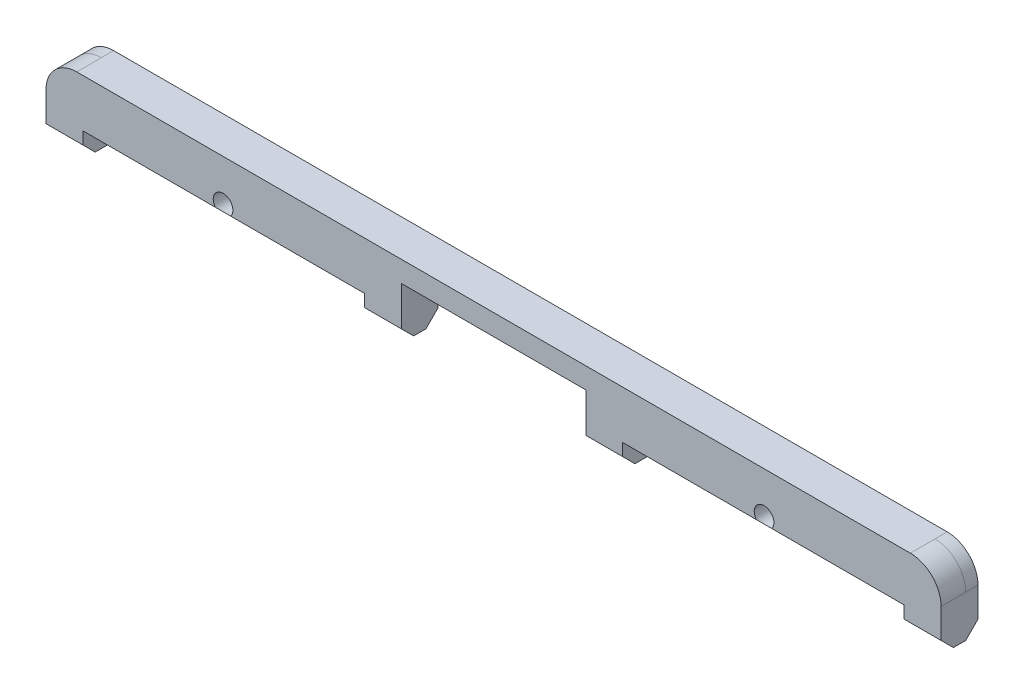
ISO-10303-21;
HEADER;
FILE_DESCRIPTION(('STEP AP214'),'2;1');
FILE_NAME('part.step','',(''),(''),'','','');
FILE_SCHEMA(('AUTOMOTIVE_DESIGN { 1 0 10303 214 1 1 1 1 }'));
ENDSEC;
DATA;
#1=APPLICATION_CONTEXT('core data for automotive mechanical design processes');
#2=APPLICATION_PROTOCOL_DEFINITION('international standard','automotive_design',2000,#1);
#3=PRODUCT_CONTEXT('',#1,'mechanical');
#4=PRODUCT('Part','Part','',(#3));
#5=PRODUCT_RELATED_PRODUCT_CATEGORY('part','',(#4));
#6=PRODUCT_DEFINITION_FORMATION('','',#4);
#7=PRODUCT_DEFINITION_CONTEXT('part definition',#1,'design');
#8=PRODUCT_DEFINITION('design','',#6,#7);
#9=PRODUCT_DEFINITION_SHAPE('','',#8);
#10=(LENGTH_UNIT() NAMED_UNIT(*) SI_UNIT(.MILLI.,.METRE.));
#11=(NAMED_UNIT(*) PLANE_ANGLE_UNIT() SI_UNIT($,.RADIAN.));
#12=(NAMED_UNIT(*) SI_UNIT($,.STERADIAN.) SOLID_ANGLE_UNIT());
#13=UNCERTAINTY_MEASURE_WITH_UNIT(LENGTH_MEASURE(1.E-05),#10,'distance_accuracy_value','');
#14=(GEOMETRIC_REPRESENTATION_CONTEXT(3) GLOBAL_UNCERTAINTY_ASSIGNED_CONTEXT((#13)) GLOBAL_UNIT_ASSIGNED_CONTEXT((#10,
#11,#12)) REPRESENTATION_CONTEXT('',''));
#15=CARTESIAN_POINT('',(0.,0.,0.));
#16=DIRECTION('',(0.,0.,1.));
#17=DIRECTION('',(1.,0.,0.));
#18=AXIS2_PLACEMENT_3D('',#15,#16,#17);
#19=CARTESIAN_POINT('',(39.6015621187164,-2.7,0.));
#20=DIRECTION('',(0.,0.707106781186547,-0.707106781186548));
#21=DIRECTION('',(0.,0.707106781186548,0.707106781186547));
#22=AXIS2_PLACEMENT_3D('',#19,#20,#21);
#23=PLANE('',#22);
#24=DIRECTION('',(-1.,0.,0.));
#25=VECTOR('',#24,1.);
#26=CARTESIAN_POINT('',(39.6015621187164,-0.699999999999999,2.));
#27=LINE('',#26,#25);
#28=CARTESIAN_POINT('',(-22.6244997998393,-0.699999999999999,2.));
#29=VERTEX_POINT('',#28);
#30=CARTESIAN_POINT('',(-33.4,-0.699999999999999,2.));
#31=VERTEX_POINT('',#30);
#32=EDGE_CURVE('E401',#29,#31,#27,.T.);
#33=ORIENTED_EDGE('',*,*,#32,.T.);
#34=DIRECTION('',(0.,0.707106781186548,0.707106781186547));
#35=VECTOR('',#34,1.);
#36=CARTESIAN_POINT('',(-33.4,-2.7,0.));
#37=LINE('',#36,#35);
#38=CARTESIAN_POINT('',(-33.4,-2.7,0.));
#39=VERTEX_POINT('',#38);
#40=EDGE_CURVE('E258',#39,#31,#37,.T.);
#41=ORIENTED_EDGE('',*,*,#40,.F.);
#42=DIRECTION('',(-1.,0.,0.));
#43=VECTOR('',#42,1.);
#44=CARTESIAN_POINT('',(39.6015621187164,-2.7,0.));
#45=LINE('',#44,#43);
#46=CARTESIAN_POINT('',(-10.5,-2.7,0.));
#47=VERTEX_POINT('',#46);
#48=EDGE_CURVE('E423',#47,#39,#45,.T.);
#49=ORIENTED_EDGE('',*,*,#48,.F.);
#50=DIRECTION('',(0.,-0.707106781186548,-0.707106781186547));
#51=VECTOR('',#50,1.);
#52=CARTESIAN_POINT('',(-10.5,-2.7,0.));
#53=LINE('',#52,#51);
#54=CARTESIAN_POINT('',(-10.5,-0.699999999999999,2.));
#55=VERTEX_POINT('',#54);
#56=EDGE_CURVE('E59',#55,#47,#53,.T.);
#57=ORIENTED_EDGE('',*,*,#56,.F.);
#58=CARTESIAN_POINT('',(-21.3755002001601,-0.699999999999998,2.));
#59=VERTEX_POINT('',#58);
#60=EDGE_CURVE('E428',#55,#59,#27,.T.);
#61=ORIENTED_EDGE('',*,*,#60,.T.);
#62=CARTESIAN_POINT('',(-21.9999999999997,-0.199999999999756,2.50000000000024));
#63=DIRECTION('',(0.,0.707106781186547,-0.707106781186548));
#64=DIRECTION('',(0.,0.707106781186548,0.707106781186547));
#65=AXIS2_PLACEMENT_3D('',#62,#63,#64);
#66=ELLIPSE('',#65,1.13137084989846,0.799999999999988);
#67=EDGE_CURVE('E467',#59,#29,#66,.T.);
#68=ORIENTED_EDGE('',*,*,#67,.T.);
#69=EDGE_LOOP('',(#33,#41,#49,#57,#61,#68));
#70=FACE_BOUND('',#69,.T.);
#71=ADVANCED_FACE('F43',(#70),#23,.F.);
#72=DIRECTION('',(0.,-0.707106781186548,-0.707106781186547));
#73=VECTOR('',#72,1.);
#74=CARTESIAN_POINT('',(10.5,-2.7,0.));
#75=LINE('',#74,#73);
#76=CARTESIAN_POINT('',(10.5,-0.699999999999999,2.));
#77=VERTEX_POINT('',#76);
#78=CARTESIAN_POINT('',(10.5,-2.7,0.));
#79=VERTEX_POINT('',#78);
#80=EDGE_CURVE('E290',#77,#79,#75,.T.);
#81=ORIENTED_EDGE('',*,*,#80,.T.);
#82=CARTESIAN_POINT('',(33.4,-2.7,0.));
#83=VERTEX_POINT('',#82);
#84=EDGE_CURVE('E422',#83,#79,#45,.T.);
#85=ORIENTED_EDGE('',*,*,#84,.F.);
#86=DIRECTION('',(0.,0.707106781186548,0.707106781186547));
#87=VECTOR('',#86,1.);
#88=CARTESIAN_POINT('',(33.4,-2.7,0.));
#89=LINE('',#88,#87);
#90=CARTESIAN_POINT('',(33.4,-0.699999999999999,2.));
#91=VERTEX_POINT('',#90);
#92=EDGE_CURVE('E67',#83,#91,#89,.T.);
#93=ORIENTED_EDGE('',*,*,#92,.T.);
#94=CARTESIAN_POINT('',(22.6244997998399,-0.699999999999998,2.));
#95=VERTEX_POINT('',#94);
#96=EDGE_CURVE('E424',#91,#95,#27,.T.);
#97=ORIENTED_EDGE('',*,*,#96,.T.);
#98=CARTESIAN_POINT('',(22.0000000000003,-0.199999999999756,2.50000000000024));
#99=DIRECTION('',(0.,0.707106781186547,-0.707106781186548));
#100=DIRECTION('',(0.,0.707106781186548,0.707106781186547));
#101=AXIS2_PLACEMENT_3D('',#98,#99,#100);
#102=ELLIPSE('',#101,1.13137084989846,0.79999999999999);
#103=CARTESIAN_POINT('',(21.3755002001607,-0.699999999999999,2.));
#104=VERTEX_POINT('',#103);
#105=EDGE_CURVE('E464',#95,#104,#102,.T.);
#106=ORIENTED_EDGE('',*,*,#105,.T.);
#107=EDGE_CURVE('E427',#104,#77,#27,.T.);
#108=ORIENTED_EDGE('',*,*,#107,.T.);
#109=EDGE_LOOP('',(#81,#85,#93,#97,#106,#108));
#110=FACE_BOUND('',#109,.T.);
#111=ADVANCED_FACE('F521',(#110),#23,.F.);
#112=CARTESIAN_POINT('',(36.4,-1.2,2.));
#113=DIRECTION('',(0.,0.,-1.));
#114=DIRECTION('',(-1.,0.,0.));
#115=AXIS2_PLACEMENT_3D('',#112,#113,#114);
#116=PLANE('',#115);
#117=DIRECTION('',(-1.,0.,0.));
#118=VECTOR('',#117,1.);
#119=CARTESIAN_POINT('',(36.4,1.49999999999995,2.));
#120=LINE('',#119,#118);
#121=CARTESIAN_POINT('',(7.50000000000001,1.49999999999994,2.));
#122=VERTEX_POINT('',#121);
#123=CARTESIAN_POINT('',(-7.50000000000001,1.49999999999994,2.));
#124=VERTEX_POINT('',#123);
#125=EDGE_CURVE('E368',#122,#124,#120,.T.);
#126=ORIENTED_EDGE('',*,*,#125,.F.);
#127=DIRECTION('',(0.,1.,0.));
#128=VECTOR('',#127,1.);
#129=CARTESIAN_POINT('',(7.50000000000001,-1.20000000000001,2.));
#130=LINE('',#129,#128);
#131=CARTESIAN_POINT('',(7.50000000000001,-1.7,2.));
#132=VERTEX_POINT('',#131);
#133=EDGE_CURVE('E375',#132,#122,#130,.T.);
#134=ORIENTED_EDGE('',*,*,#133,.F.);
#135=DIRECTION('',(-1.,0.,0.));
#136=VECTOR('',#135,1.);
#137=CARTESIAN_POINT('',(10.5,-1.7,2.));
#138=LINE('',#137,#136);
#139=CARTESIAN_POINT('',(10.5,-1.7,2.));
#140=VERTEX_POINT('',#139);
#141=EDGE_CURVE('E314',#140,#132,#138,.T.);
#142=ORIENTED_EDGE('',*,*,#141,.F.);
#143=DIRECTION('',(0.,1.,0.));
#144=VECTOR('',#143,1.);
#145=CARTESIAN_POINT('',(10.5,-1.7,2.));
#146=LINE('',#145,#144);
#147=EDGE_CURVE('E303',#140,#77,#146,.T.);
#148=ORIENTED_EDGE('',*,*,#147,.T.);
#149=ORIENTED_EDGE('',*,*,#107,.F.);
#150=CARTESIAN_POINT('',(22.0000000000003,-0.199999999999756,2.));
#151=DIRECTION('',(0.,0.,1.));
#152=DIRECTION('',(1.,0.,0.));
#153=AXIS2_PLACEMENT_3D('',#150,#151,#152);
#154=CIRCLE('',#153,0.799999999999992);
#155=EDGE_CURVE('E385',#95,#104,#154,.T.);
#156=ORIENTED_EDGE('',*,*,#155,.F.);
#157=ORIENTED_EDGE('',*,*,#96,.F.);
#158=DIRECTION('',(0.,-1.,0.));
#159=VECTOR('',#158,1.);
#160=CARTESIAN_POINT('',(33.4,-1.7,2.));
#161=LINE('',#160,#159);
#162=CARTESIAN_POINT('',(33.4,-1.7,2.));
#163=VERTEX_POINT('',#162);
#164=EDGE_CURVE('E327',#91,#163,#161,.T.);
#165=ORIENTED_EDGE('',*,*,#164,.T.);
#166=DIRECTION('',(1.,0.,0.));
#167=VECTOR('',#166,1.);
#168=CARTESIAN_POINT('',(33.4,-1.7,2.));
#169=LINE('',#168,#167);
#170=CARTESIAN_POINT('',(36.4,-1.7,2.));
#171=VERTEX_POINT('',#170);
#172=EDGE_CURVE('E340',#163,#171,#169,.T.);
#173=ORIENTED_EDGE('',*,*,#172,.T.);
#174=DIRECTION('',(0.,-1.,0.));
#175=VECTOR('',#174,1.);
#176=CARTESIAN_POINT('',(36.4,-1.2,2.));
#177=LINE('',#176,#175);
#178=CARTESIAN_POINT('',(36.4,0.7,2.));
#179=VERTEX_POINT('',#178);
#180=EDGE_CURVE('E429',#179,#171,#177,.T.);
#181=ORIENTED_EDGE('',*,*,#180,.F.);
#182=CARTESIAN_POINT('',(33.9,0.7,2.));
#183=DIRECTION('',(0.,0.,-1.));
#184=DIRECTION('',(-1.,0.,0.));
#185=AXIS2_PLACEMENT_3D('',#182,#183,#184);
#186=CIRCLE('',#185,2.5);
#187=CARTESIAN_POINT('',(33.9,3.2,2.));
#188=VERTEX_POINT('',#187);
#189=EDGE_CURVE('E444',#179,#188,#186,.F.);
#190=ORIENTED_EDGE('',*,*,#189,.T.);
#191=DIRECTION('',(-1.,0.,0.));
#192=VECTOR('',#191,1.);
#193=CARTESIAN_POINT('',(36.4,3.2,2.));
#194=LINE('',#193,#192);
#195=CARTESIAN_POINT('',(-33.9,3.2,2.));
#196=VERTEX_POINT('',#195);
#197=EDGE_CURVE('E432',#188,#196,#194,.T.);
#198=ORIENTED_EDGE('',*,*,#197,.T.);
#199=CARTESIAN_POINT('',(-33.9,0.7,2.));
#200=DIRECTION('',(0.,0.,-1.));
#201=DIRECTION('',(-1.,0.,0.));
#202=AXIS2_PLACEMENT_3D('',#199,#200,#201);
#203=CIRCLE('',#202,2.5);
#204=CARTESIAN_POINT('',(-36.4,0.7,2.));
#205=VERTEX_POINT('',#204);
#206=EDGE_CURVE('E447',#196,#205,#203,.F.);
#207=ORIENTED_EDGE('',*,*,#206,.T.);
#208=DIRECTION('',(0.,-1.,0.));
#209=VECTOR('',#208,1.);
#210=CARTESIAN_POINT('',(-36.4,-1.2,2.));
#211=LINE('',#210,#209);
#212=CARTESIAN_POINT('',(-36.4,-1.7,2.));
#213=VERTEX_POINT('',#212);
#214=EDGE_CURVE('E421',#205,#213,#211,.T.);
#215=ORIENTED_EDGE('',*,*,#214,.T.);
#216=DIRECTION('',(-1.,0.,0.));
#217=VECTOR('',#216,1.);
#218=CARTESIAN_POINT('',(-33.4,-1.7,2.));
#219=LINE('',#218,#217);
#220=CARTESIAN_POINT('',(-33.4,-1.7,2.));
#221=VERTEX_POINT('',#220);
#222=EDGE_CURVE('E273',#221,#213,#219,.T.);
#223=ORIENTED_EDGE('',*,*,#222,.F.);
#224=DIRECTION('',(0.,-1.,0.));
#225=VECTOR('',#224,1.);
#226=CARTESIAN_POINT('',(-33.4,-1.7,2.));
#227=LINE('',#226,#225);
#228=EDGE_CURVE('E262',#31,#221,#227,.T.);
#229=ORIENTED_EDGE('',*,*,#228,.F.);
#230=ORIENTED_EDGE('',*,*,#32,.F.);
#231=CARTESIAN_POINT('',(-21.9999999999997,-0.199999999999756,2.));
#232=DIRECTION('',(0.,0.,1.));
#233=DIRECTION('',(1.,0.,0.));
#234=AXIS2_PLACEMENT_3D('',#231,#232,#233);
#235=CIRCLE('',#234,0.799999999999988);
#236=EDGE_CURVE('E378',#59,#29,#235,.T.);
#237=ORIENTED_EDGE('',*,*,#236,.F.);
#238=ORIENTED_EDGE('',*,*,#60,.F.);
#239=DIRECTION('',(0.,1.,0.));
#240=VECTOR('',#239,1.);
#241=CARTESIAN_POINT('',(-10.5,-1.7,2.));
#242=LINE('',#241,#240);
#243=CARTESIAN_POINT('',(-10.5,-1.7,2.));
#244=VERTEX_POINT('',#243);
#245=EDGE_CURVE('E240',#244,#55,#242,.T.);
#246=ORIENTED_EDGE('',*,*,#245,.F.);
#247=DIRECTION('',(1.,0.,0.));
#248=VECTOR('',#247,1.);
#249=CARTESIAN_POINT('',(-10.5,-1.7,2.));
#250=LINE('',#249,#248);
#251=CARTESIAN_POINT('',(-7.50000000000001,-1.7,2.));
#252=VERTEX_POINT('',#251);
#253=EDGE_CURVE('E233',#244,#252,#250,.T.);
#254=ORIENTED_EDGE('',*,*,#253,.T.);
#255=DIRECTION('',(0.,-1.,0.));
#256=VECTOR('',#255,1.);
#257=CARTESIAN_POINT('',(-7.50000000000001,-1.20000000000001,2.));
#258=LINE('',#257,#256);
#259=EDGE_CURVE('E365',#124,#252,#258,.T.);
#260=ORIENTED_EDGE('',*,*,#259,.F.);
#261=EDGE_LOOP('',(#126,#134,#142,#148,#149,#156,#157,#165,#173,#181,#190,#198,#207,#215,#223,
#229,#230,#237,#238,#246,#254,#260));
#262=FACE_BOUND('',#261,.T.);
#263=ADVANCED_FACE('F509',(#262),#116,.F.);
#264=CARTESIAN_POINT('',(42.3841457201509,-2.7,0.));
#265=DIRECTION('',(0.,-0.707106781186544,-0.707106781186551));
#266=DIRECTION('',(0.,0.707106781186551,-0.707106781186544));
#267=AXIS2_PLACEMENT_3D('',#264,#265,#266);
#268=PLANE('',#267);
#269=CARTESIAN_POINT('',(36.4,-2.7,0.));
#270=VERTEX_POINT('',#269);
#271=EDGE_CURVE('E417',#270,#83,#45,.T.);
#272=ORIENTED_EDGE('',*,*,#271,.T.);
#273=ORIENTED_EDGE('',*,*,#84,.T.);
#274=DIRECTION('',(-1.,0.,0.));
#275=VECTOR('',#274,1.);
#276=CARTESIAN_POINT('',(10.5,-2.7,0.));
#277=LINE('',#276,#275);
#278=CARTESIAN_POINT('',(7.50000000000002,-2.7,0.));
#279=VERTEX_POINT('',#278);
#280=EDGE_CURVE('E307',#79,#279,#277,.T.);
#281=ORIENTED_EDGE('',*,*,#280,.T.);
#282=DIRECTION('',(0.,0.707106781186551,-0.707106781186544));
#283=VECTOR('',#282,1.);
#284=CARTESIAN_POINT('',(7.50000000000001,-2.7,0.));
#285=LINE('',#284,#283);
#286=CARTESIAN_POINT('',(7.50000000000001,-1.69999999999999,-1.));
#287=VERTEX_POINT('',#286);
#288=EDGE_CURVE('E371',#279,#287,#285,.T.);
#289=ORIENTED_EDGE('',*,*,#288,.T.);
#290=DIRECTION('',(-1.,0.,0.));
#291=VECTOR('',#290,1.);
#292=CARTESIAN_POINT('',(42.3841457201509,-1.69999999999999,-1.));
#293=LINE('',#292,#291);
#294=CARTESIAN_POINT('',(36.4,-1.69999999999999,-1.));
#295=VERTEX_POINT('',#294);
#296=EDGE_CURVE('E398',#295,#287,#293,.T.);
#297=ORIENTED_EDGE('',*,*,#296,.F.);
#298=DIRECTION('',(0.,0.707106781186551,-0.707106781186544));
#299=VECTOR('',#298,1.);
#300=CARTESIAN_POINT('',(36.4,-2.7,0.));
#301=LINE('',#300,#299);
#302=EDGE_CURVE('E397',#270,#295,#301,.T.);
#303=ORIENTED_EDGE('',*,*,#302,.F.);
#304=EDGE_LOOP('',(#272,#273,#281,#289,#297,#303));
#305=FACE_BOUND('',#304,.T.);
#306=ADVANCED_FACE('F561',(#305),#268,.T.);
#307=CARTESIAN_POINT('',(-7.50000000000001,-1.69999999999999,-1.));
#308=VERTEX_POINT('',#307);
#309=CARTESIAN_POINT('',(-36.4,-1.69999999999999,-1.));
#310=VERTEX_POINT('',#309);
#311=EDGE_CURVE('E413',#308,#310,#293,.T.);
#312=ORIENTED_EDGE('',*,*,#311,.F.);
#313=DIRECTION('',(0.,-0.707106781186551,0.707106781186544));
#314=VECTOR('',#313,1.);
#315=CARTESIAN_POINT('',(-7.50000000000001,-2.70000000000001,0.));
#316=LINE('',#315,#314);
#317=CARTESIAN_POINT('',(-7.50000000000002,-2.7,0.));
#318=VERTEX_POINT('',#317);
#319=EDGE_CURVE('E361',#308,#318,#316,.T.);
#320=ORIENTED_EDGE('',*,*,#319,.T.);
#321=DIRECTION('',(1.,0.,0.));
#322=VECTOR('',#321,1.);
#323=CARTESIAN_POINT('',(-10.5,-2.7,0.));
#324=LINE('',#323,#322);
#325=EDGE_CURVE('E234',#47,#318,#324,.T.);
#326=ORIENTED_EDGE('',*,*,#325,.F.);
#327=ORIENTED_EDGE('',*,*,#48,.T.);
#328=DIRECTION('',(1.,0.,0.));
#329=VECTOR('',#328,1.);
#330=CARTESIAN_POINT('',(-39.6015621187164,-2.7,0.));
#331=LINE('',#330,#329);
#332=CARTESIAN_POINT('',(-36.4,-2.7,0.));
#333=VERTEX_POINT('',#332);
#334=EDGE_CURVE('E282',#333,#39,#331,.T.);
#335=ORIENTED_EDGE('',*,*,#334,.F.);
#336=DIRECTION('',(0.,-0.707106781186551,0.707106781186544));
#337=VECTOR('',#336,1.);
#338=CARTESIAN_POINT('',(-36.4,-2.7,0.));
#339=LINE('',#338,#337);
#340=EDGE_CURVE('E405',#310,#333,#339,.T.);
#341=ORIENTED_EDGE('',*,*,#340,.F.);
#342=EDGE_LOOP('',(#312,#320,#326,#327,#335,#341));
#343=FACE_BOUND('',#342,.T.);
#344=ADVANCED_FACE('F546',(#343),#268,.T.);
#345=CARTESIAN_POINT('',(42.3841457201509,-1.69999999999999,-1.));
#346=DIRECTION('',(0.,0.,-1.));
#347=DIRECTION('',(-1.,0.,0.));
#348=AXIS2_PLACEMENT_3D('',#345,#346,#347);
#349=PLANE('',#348);
#350=CARTESIAN_POINT('',(22.0000000000003,-0.199999999999756,-1.));
#351=DIRECTION('',(0.,0.,-1.));
#352=DIRECTION('',(-1.,0.,0.));
#353=AXIS2_PLACEMENT_3D('',#350,#351,#352);
#354=CIRCLE('',#353,0.79999999999999);
#355=CARTESIAN_POINT('',(21.2000000000003,-0.199999999999756,-1.));
#356=VERTEX_POINT('',#355);
#357=EDGE_CURVE('E388',#356,#356,#354,.T.);
#358=ORIENTED_EDGE('',*,*,#357,.F.);
#359=EDGE_LOOP('',(#358));
#360=FACE_BOUND('',#359,.T.);
#361=CARTESIAN_POINT('',(-21.9999999999997,-0.199999999999756,-1.));
#362=DIRECTION('',(0.,0.,-1.));
#363=DIRECTION('',(-1.,0.,0.));
#364=AXIS2_PLACEMENT_3D('',#361,#362,#363);
#365=CIRCLE('',#364,0.799999999999988);
#366=CARTESIAN_POINT('',(-22.7999999999997,-0.199999999999756,-1.));
#367=VERTEX_POINT('',#366);
#368=EDGE_CURVE('E381',#367,#367,#365,.T.);
#369=ORIENTED_EDGE('',*,*,#368,.F.);
#370=EDGE_LOOP('',(#369));
#371=FACE_BOUND('',#370,.T.);
#372=ORIENTED_EDGE('',*,*,#296,.T.);
#373=DIRECTION('',(0.,1.,0.));
#374=VECTOR('',#373,1.);
#375=CARTESIAN_POINT('',(7.50000000000001,-1.7,-1.));
#376=LINE('',#375,#374);
#377=CARTESIAN_POINT('',(7.50000000000001,1.49999999999994,-1.));
#378=VERTEX_POINT('',#377);
#379=EDGE_CURVE('E11',#287,#378,#376,.T.);
#380=ORIENTED_EDGE('',*,*,#379,.T.);
#381=DIRECTION('',(-1.,0.,0.));
#382=VECTOR('',#381,1.);
#383=CARTESIAN_POINT('',(42.3841457201509,1.49999999999995,-1.));
#384=LINE('',#383,#382);
#385=CARTESIAN_POINT('',(-7.50000000000001,1.49999999999994,-1.));
#386=VERTEX_POINT('',#385);
#387=EDGE_CURVE('E52',#378,#386,#384,.T.);
#388=ORIENTED_EDGE('',*,*,#387,.T.);
#389=DIRECTION('',(0.,-1.,0.));
#390=VECTOR('',#389,1.);
#391=CARTESIAN_POINT('',(-7.50000000000001,-1.7,-1.));
#392=LINE('',#391,#390);
#393=EDGE_CURVE('E491',#386,#308,#392,.T.);
#394=ORIENTED_EDGE('',*,*,#393,.T.);
#395=ORIENTED_EDGE('',*,*,#311,.T.);
#396=DIRECTION('',(0.,-1.,0.));
#397=VECTOR('',#396,1.);
#398=CARTESIAN_POINT('',(-36.4,-1.69999999999999,-1.));
#399=LINE('',#398,#397);
#400=CARTESIAN_POINT('',(-36.4,0.7,-1.));
#401=VERTEX_POINT('',#400);
#402=EDGE_CURVE('E392',#401,#310,#399,.T.);
#403=ORIENTED_EDGE('',*,*,#402,.F.);
#404=CARTESIAN_POINT('',(-33.9,0.7,-1.));
#405=DIRECTION('',(0.,0.,-1.));
#406=DIRECTION('',(-1.,0.,0.));
#407=AXIS2_PLACEMENT_3D('',#404,#405,#406);
#408=CIRCLE('',#407,2.5);
#409=CARTESIAN_POINT('',(-33.9,3.2,-1.));
#410=VERTEX_POINT('',#409);
#411=EDGE_CURVE('E478',#401,#410,#408,.T.);
#412=ORIENTED_EDGE('',*,*,#411,.T.);
#413=DIRECTION('',(-1.,0.,0.));
#414=VECTOR('',#413,1.);
#415=CARTESIAN_POINT('',(42.3841457201509,3.2,-1.));
#416=LINE('',#415,#414);
#417=CARTESIAN_POINT('',(33.9,3.2,-1.));
#418=VERTEX_POINT('',#417);
#419=EDGE_CURVE('E409',#418,#410,#416,.T.);
#420=ORIENTED_EDGE('',*,*,#419,.F.);
#421=CARTESIAN_POINT('',(33.9,0.7,-1.));
#422=DIRECTION('',(0.,0.,-1.));
#423=DIRECTION('',(-1.,0.,0.));
#424=AXIS2_PLACEMENT_3D('',#421,#422,#423);
#425=CIRCLE('',#424,2.5);
#426=CARTESIAN_POINT('',(36.4,0.7,-1.));
#427=VERTEX_POINT('',#426);
#428=EDGE_CURVE('E475',#418,#427,#425,.T.);
#429=ORIENTED_EDGE('',*,*,#428,.T.);
#430=DIRECTION('',(0.,1.,0.));
#431=VECTOR('',#430,1.);
#432=CARTESIAN_POINT('',(36.4,-1.69999999999999,-1.));
#433=LINE('',#432,#431);
#434=EDGE_CURVE('E393',#295,#427,#433,.T.);
#435=ORIENTED_EDGE('',*,*,#434,.F.);
#436=EDGE_LOOP('',(#372,#380,#388,#394,#395,#403,#412,#420,#429,#435));
#437=FACE_BOUND('',#436,.T.);
#438=ADVANCED_FACE('F497',(#360,#371,#437),#349,.T.);
#439=CARTESIAN_POINT('',(36.4,3.2,2.));
#440=DIRECTION('',(0.,-1.,0.));
#441=DIRECTION('',(0.,0.,-1.));
#442=AXIS2_PLACEMENT_3D('',#439,#440,#441);
#443=PLANE('',#442);
#444=ORIENTED_EDGE('',*,*,#419,.T.);
#445=DIRECTION('',(0.,0.,-1.));
#446=VECTOR('',#445,1.);
#447=CARTESIAN_POINT('',(-33.9,3.2,0.));
#448=LINE('',#447,#446);
#449=CARTESIAN_POINT('',(-33.9,3.2,0.));
#450=VERTEX_POINT('',#449);
#451=EDGE_CURVE('E484',#410,#450,#448,.F.);
#452=ORIENTED_EDGE('',*,*,#451,.T.);
#453=DIRECTION('',(0.,0.,1.));
#454=VECTOR('',#453,1.);
#455=CARTESIAN_POINT('',(-33.9,3.2,2.));
#456=LINE('',#455,#454);
#457=EDGE_CURVE('E440',#450,#196,#456,.T.);
#458=ORIENTED_EDGE('',*,*,#457,.T.);
#459=ORIENTED_EDGE('',*,*,#197,.F.);
#460=DIRECTION('',(0.,0.,1.));
#461=VECTOR('',#460,1.);
#462=CARTESIAN_POINT('',(33.9,3.2,2.));
#463=LINE('',#462,#461);
#464=CARTESIAN_POINT('',(33.9,3.2,0.));
#465=VERTEX_POINT('',#464);
#466=EDGE_CURVE('E438',#188,#465,#463,.F.);
#467=ORIENTED_EDGE('',*,*,#466,.T.);
#468=DIRECTION('',(0.,0.,1.));
#469=VECTOR('',#468,1.);
#470=CARTESIAN_POINT('',(33.9,3.2,2.));
#471=LINE('',#470,#469);
#472=EDGE_CURVE('E481',#465,#418,#471,.F.);
#473=ORIENTED_EDGE('',*,*,#472,.T.);
#474=EDGE_LOOP('',(#444,#452,#458,#459,#467,#473));
#475=FACE_BOUND('',#474,.T.);
#476=ADVANCED_FACE('F604',(#475),#443,.F.);
#477=CARTESIAN_POINT('',(36.4,0.,0.));
#478=DIRECTION('',(-1.,0.,0.));
#479=DIRECTION('',(0.,0.,1.));
#480=AXIS2_PLACEMENT_3D('',#477,#478,#479);
#481=PLANE('',#480);
#482=ORIENTED_EDGE('',*,*,#180,.T.);
#483=DIRECTION('',(0.,-0.707106781186548,-0.707106781186547));
#484=VECTOR('',#483,1.);
#485=CARTESIAN_POINT('',(36.4,-2.7,0.999999999999999));
#486=LINE('',#485,#484);
#487=CARTESIAN_POINT('',(36.4,-2.7,0.999999999999999));
#488=VERTEX_POINT('',#487);
#489=EDGE_CURVE('E318',#171,#488,#486,.T.);
#490=ORIENTED_EDGE('',*,*,#489,.T.);
#491=DIRECTION('',(0.,0.,-1.));
#492=VECTOR('',#491,1.);
#493=CARTESIAN_POINT('',(36.4,-2.7,0.));
#494=LINE('',#493,#492);
#495=EDGE_CURVE('E328',#488,#270,#494,.T.);
#496=ORIENTED_EDGE('',*,*,#495,.T.);
#497=ORIENTED_EDGE('',*,*,#302,.T.);
#498=ORIENTED_EDGE('',*,*,#434,.T.);
#499=DIRECTION('',(0.,0.,1.));
#500=VECTOR('',#499,1.);
#501=CARTESIAN_POINT('',(36.4,0.7,0.));
#502=LINE('',#501,#500);
#503=CARTESIAN_POINT('',(36.4,0.7,0.));
#504=VERTEX_POINT('',#503);
#505=EDGE_CURVE('E487',#427,#504,#502,.T.);
#506=ORIENTED_EDGE('',*,*,#505,.T.);
#507=DIRECTION('',(0.,0.,1.));
#508=VECTOR('',#507,1.);
#509=CARTESIAN_POINT('',(36.4,0.7,0.));
#510=LINE('',#509,#508);
#511=EDGE_CURVE('E460',#504,#179,#510,.T.);
#512=ORIENTED_EDGE('',*,*,#511,.T.);
#513=EDGE_LOOP('',(#482,#490,#496,#497,#498,#506,#512));
#514=FACE_BOUND('',#513,.T.);
#515=ADVANCED_FACE('F601',(#514),#481,.F.);
#516=CARTESIAN_POINT('',(-36.4,0.,0.));
#517=DIRECTION('',(-1.,0.,0.));
#518=DIRECTION('',(0.,0.,1.));
#519=AXIS2_PLACEMENT_3D('',#516,#517,#518);
#520=PLANE('',#519);
#521=DIRECTION('',(0.,0.,1.));
#522=VECTOR('',#521,1.);
#523=CARTESIAN_POINT('',(-36.4,0.7,0.));
#524=LINE('',#523,#522);
#525=CARTESIAN_POINT('',(-36.4,0.7,0.));
#526=VERTEX_POINT('',#525);
#527=EDGE_CURVE('E450',#205,#526,#524,.F.);
#528=ORIENTED_EDGE('',*,*,#527,.T.);
#529=DIRECTION('',(0.,0.,-1.));
#530=VECTOR('',#529,1.);
#531=CARTESIAN_POINT('',(-36.4,0.7,-1.));
#532=LINE('',#531,#530);
#533=EDGE_CURVE('E471',#526,#401,#532,.T.);
#534=ORIENTED_EDGE('',*,*,#533,.T.);
#535=ORIENTED_EDGE('',*,*,#402,.T.);
#536=ORIENTED_EDGE('',*,*,#340,.T.);
#537=DIRECTION('',(0.,0.,-1.));
#538=VECTOR('',#537,1.);
#539=CARTESIAN_POINT('',(-36.4,-2.7,0.));
#540=LINE('',#539,#538);
#541=CARTESIAN_POINT('',(-36.4,-2.7,0.999999999999999));
#542=VERTEX_POINT('',#541);
#543=EDGE_CURVE('E263',#542,#333,#540,.T.);
#544=ORIENTED_EDGE('',*,*,#543,.F.);
#545=DIRECTION('',(0.,-0.707106781186548,-0.707106781186547));
#546=VECTOR('',#545,1.);
#547=CARTESIAN_POINT('',(-36.4,-2.7,0.999999999999999));
#548=LINE('',#547,#546);
#549=EDGE_CURVE('E254',#213,#542,#548,.T.);
#550=ORIENTED_EDGE('',*,*,#549,.F.);
#551=ORIENTED_EDGE('',*,*,#214,.F.);
#552=EDGE_LOOP('',(#528,#534,#535,#536,#544,#550,#551));
#553=FACE_BOUND('',#552,.T.);
#554=ADVANCED_FACE('F549',(#553),#520,.T.);
#555=CARTESIAN_POINT('',(-33.9,0.7,2.));
#556=DIRECTION('',(0.,0.,-1.));
#557=DIRECTION('',(-1.,0.,0.));
#558=AXIS2_PLACEMENT_3D('',#555,#556,#557);
#559=CYLINDRICAL_SURFACE('',#558,2.5);
#560=CARTESIAN_POINT('',(-33.9,0.7,0.));
#561=DIRECTION('',(0.,0.,1.));
#562=DIRECTION('',(1.,0.,0.));
#563=AXIS2_PLACEMENT_3D('',#560,#561,#562);
#564=CIRCLE('',#563,2.5);
#565=EDGE_CURVE('E456',#526,#450,#564,.F.);
#566=ORIENTED_EDGE('',*,*,#565,.F.);
#567=ORIENTED_EDGE('',*,*,#527,.F.);
#568=ORIENTED_EDGE('',*,*,#206,.F.);
#569=ORIENTED_EDGE('',*,*,#457,.F.);
#570=EDGE_LOOP('',(#566,#567,#568,#569));
#571=FACE_BOUND('',#570,.T.);
#572=ADVANCED_FACE('F590',(#571),#559,.T.);
#573=CARTESIAN_POINT('',(33.9,0.7,0.));
#574=DIRECTION('',(0.,0.,1.));
#575=DIRECTION('',(1.,0.,0.));
#576=AXIS2_PLACEMENT_3D('',#573,#574,#575);
#577=CYLINDRICAL_SURFACE('',#576,2.5);
#578=CARTESIAN_POINT('',(33.9,0.7,0.));
#579=DIRECTION('',(0.,0.,1.));
#580=DIRECTION('',(1.,0.,0.));
#581=AXIS2_PLACEMENT_3D('',#578,#579,#580);
#582=CIRCLE('',#581,2.5);
#583=EDGE_CURVE('E453',#465,#504,#582,.F.);
#584=ORIENTED_EDGE('',*,*,#583,.F.);
#585=ORIENTED_EDGE('',*,*,#466,.F.);
#586=ORIENTED_EDGE('',*,*,#189,.F.);
#587=ORIENTED_EDGE('',*,*,#511,.F.);
#588=EDGE_LOOP('',(#584,#585,#586,#587));
#589=FACE_BOUND('',#588,.T.);
#590=ADVANCED_FACE('F580',(#589),#577,.T.);
#591=CARTESIAN_POINT('',(22.0000000000003,-0.199999999999756,2.));
#592=DIRECTION('',(0.,0.,1.));
#593=DIRECTION('',(1.,0.,0.));
#594=AXIS2_PLACEMENT_3D('',#591,#592,#593);
#595=CYLINDRICAL_SURFACE('',#594,0.79999999999999);
#596=ORIENTED_EDGE('',*,*,#357,.T.);
#597=EDGE_LOOP('',(#596));
#598=FACE_BOUND('',#597,.T.);
#599=ORIENTED_EDGE('',*,*,#155,.T.);
#600=ORIENTED_EDGE('',*,*,#105,.F.);
#601=EDGE_LOOP('',(#599,#600));
#602=FACE_BOUND('',#601,.T.);
#603=ADVANCED_FACE('F577',(#598,#602),#595,.F.);
#604=CARTESIAN_POINT('',(-21.9999999999997,-0.199999999999756,2.));
#605=DIRECTION('',(0.,0.,1.));
#606=DIRECTION('',(1.,0.,0.));
#607=AXIS2_PLACEMENT_3D('',#604,#605,#606);
#608=CYLINDRICAL_SURFACE('',#607,0.799999999999988);
#609=ORIENTED_EDGE('',*,*,#368,.T.);
#610=EDGE_LOOP('',(#609));
#611=FACE_BOUND('',#610,.T.);
#612=ORIENTED_EDGE('',*,*,#236,.T.);
#613=ORIENTED_EDGE('',*,*,#67,.F.);
#614=EDGE_LOOP('',(#612,#613));
#615=FACE_BOUND('',#614,.T.);
#616=ADVANCED_FACE('F579',(#611,#615),#608,.F.);
#617=CARTESIAN_POINT('',(-33.9,0.7,0.));
#618=DIRECTION('',(0.,0.,1.));
#619=DIRECTION('',(1.,0.,0.));
#620=AXIS2_PLACEMENT_3D('',#617,#618,#619);
#621=CYLINDRICAL_SURFACE('',#620,2.5);
#622=ORIENTED_EDGE('',*,*,#565,.T.);
#623=ORIENTED_EDGE('',*,*,#451,.F.);
#624=ORIENTED_EDGE('',*,*,#411,.F.);
#625=ORIENTED_EDGE('',*,*,#533,.F.);
#626=EDGE_LOOP('',(#622,#623,#624,#625));
#627=FACE_BOUND('',#626,.T.);
#628=ADVANCED_FACE('F587',(#627),#621,.T.);
#629=CARTESIAN_POINT('',(33.9,0.7,0.));
#630=DIRECTION('',(0.,0.,1.));
#631=DIRECTION('',(1.,0.,0.));
#632=AXIS2_PLACEMENT_3D('',#629,#630,#631);
#633=CYLINDRICAL_SURFACE('',#632,2.5);
#634=ORIENTED_EDGE('',*,*,#428,.F.);
#635=ORIENTED_EDGE('',*,*,#472,.F.);
#636=ORIENTED_EDGE('',*,*,#583,.T.);
#637=ORIENTED_EDGE('',*,*,#505,.F.);
#638=EDGE_LOOP('',(#634,#635,#636,#637));
#639=FACE_BOUND('',#638,.T.);
#640=ADVANCED_FACE('F45',(#639),#633,.T.);
#641=CARTESIAN_POINT('',(7.50000000000001,1.49999999999994,5.));
#642=DIRECTION('',(-1.,0.,0.));
#643=DIRECTION('',(0.,-1.,0.));
#644=AXIS2_PLACEMENT_3D('',#641,#642,#643);
#645=PLANE('',#644);
#646=ORIENTED_EDGE('',*,*,#288,.F.);
#647=DIRECTION('',(0.,0.,1.));
#648=VECTOR('',#647,1.);
#649=CARTESIAN_POINT('',(7.50000000000002,-2.7,0.));
#650=LINE('',#649,#648);
#651=CARTESIAN_POINT('',(7.50000000000002,-2.7,1.));
#652=VERTEX_POINT('',#651);
#653=EDGE_CURVE('E289',#279,#652,#650,.T.);
#654=ORIENTED_EDGE('',*,*,#653,.T.);
#655=DIRECTION('',(0.,0.707106781186548,0.707106781186547));
#656=VECTOR('',#655,1.);
#657=CARTESIAN_POINT('',(7.50000000000002,-2.7,1.));
#658=LINE('',#657,#656);
#659=EDGE_CURVE('E295',#652,#132,#658,.T.);
#660=ORIENTED_EDGE('',*,*,#659,.T.);
#661=ORIENTED_EDGE('',*,*,#133,.T.);
#662=DIRECTION('',(0.,0.,-1.));
#663=VECTOR('',#662,1.);
#664=CARTESIAN_POINT('',(7.50000000000001,1.49999999999994,5.));
#665=LINE('',#664,#663);
#666=EDGE_CURVE('E357',#122,#378,#665,.T.);
#667=ORIENTED_EDGE('',*,*,#666,.T.);
#668=ORIENTED_EDGE('',*,*,#379,.F.);
#669=EDGE_LOOP('',(#646,#654,#660,#661,#667,#668));
#670=FACE_BOUND('',#669,.T.);
#671=ADVANCED_FACE('F506',(#670),#645,.T.);
#672=CARTESIAN_POINT('',(7.50000000000001,1.49999999999994,5.));
#673=DIRECTION('',(0.,-1.,0.));
#674=DIRECTION('',(1.,0.,0.));
#675=AXIS2_PLACEMENT_3D('',#672,#673,#674);
#676=PLANE('',#675);
#677=ORIENTED_EDGE('',*,*,#125,.T.);
#678=DIRECTION('',(0.,0.,-1.));
#679=VECTOR('',#678,1.);
#680=CARTESIAN_POINT('',(-7.50000000000001,1.49999999999994,5.));
#681=LINE('',#680,#679);
#682=EDGE_CURVE('E350',#124,#386,#681,.T.);
#683=ORIENTED_EDGE('',*,*,#682,.T.);
#684=ORIENTED_EDGE('',*,*,#387,.F.);
#685=ORIENTED_EDGE('',*,*,#666,.F.);
#686=EDGE_LOOP('',(#677,#683,#684,#685));
#687=FACE_BOUND('',#686,.T.);
#688=ADVANCED_FACE('F501',(#687),#676,.T.);
#689=CARTESIAN_POINT('',(-7.50000000000001,1.49999999999994,5.));
#690=DIRECTION('',(1.,0.,0.));
#691=DIRECTION('',(0.,1.,0.));
#692=AXIS2_PLACEMENT_3D('',#689,#690,#691);
#693=PLANE('',#692);
#694=ORIENTED_EDGE('',*,*,#259,.T.);
#695=DIRECTION('',(0.,0.707106781186548,0.707106781186547));
#696=VECTOR('',#695,1.);
#697=CARTESIAN_POINT('',(-7.50000000000002,-2.7,1.));
#698=LINE('',#697,#696);
#699=CARTESIAN_POINT('',(-7.50000000000002,-2.7,1.));
#700=VERTEX_POINT('',#699);
#701=EDGE_CURVE('E250',#700,#252,#698,.T.);
#702=ORIENTED_EDGE('',*,*,#701,.F.);
#703=DIRECTION('',(0.,0.,1.));
#704=VECTOR('',#703,1.);
#705=CARTESIAN_POINT('',(-7.50000000000002,-2.7,0.));
#706=LINE('',#705,#704);
#707=EDGE_CURVE('E228',#318,#700,#706,.T.);
#708=ORIENTED_EDGE('',*,*,#707,.F.);
#709=ORIENTED_EDGE('',*,*,#319,.F.);
#710=ORIENTED_EDGE('',*,*,#393,.F.);
#711=ORIENTED_EDGE('',*,*,#682,.F.);
#712=EDGE_LOOP('',(#694,#702,#708,#709,#710,#711));
#713=FACE_BOUND('',#712,.T.);
#714=ADVANCED_FACE('F556',(#713),#693,.T.);
#715=CARTESIAN_POINT('',(33.4,-2.7,0.));
#716=DIRECTION('',(0.,-1.,0.));
#717=DIRECTION('',(0.,0.,-1.));
#718=AXIS2_PLACEMENT_3D('',#715,#716,#717);
#719=PLANE('',#718);
#720=ORIENTED_EDGE('',*,*,#495,.F.);
#721=DIRECTION('',(1.,0.,0.));
#722=VECTOR('',#721,1.);
#723=CARTESIAN_POINT('',(33.4,-2.7,0.999999999999999));
#724=LINE('',#723,#722);
#725=CARTESIAN_POINT('',(33.4,-2.7,0.999999999999999));
#726=VERTEX_POINT('',#725);
#727=EDGE_CURVE('E347',#726,#488,#724,.T.);
#728=ORIENTED_EDGE('',*,*,#727,.F.);
#729=DIRECTION('',(0.,0.,-1.));
#730=VECTOR('',#729,1.);
#731=CARTESIAN_POINT('',(33.4,-2.7,0.));
#732=LINE('',#731,#730);
#733=EDGE_CURVE('E336',#726,#83,#732,.T.);
#734=ORIENTED_EDGE('',*,*,#733,.T.);
#735=ORIENTED_EDGE('',*,*,#271,.F.);
#736=EDGE_LOOP('',(#720,#728,#734,#735));
#737=FACE_BOUND('',#736,.T.);
#738=ADVANCED_FACE('F571',(#737),#719,.T.);
#739=CARTESIAN_POINT('',(33.4,-2.7,0.999999999999999));
#740=DIRECTION('',(0.,-0.707106781186547,0.707106781186548));
#741=DIRECTION('',(0.,-0.707106781186548,-0.707106781186547));
#742=AXIS2_PLACEMENT_3D('',#739,#740,#741);
#743=PLANE('',#742);
#744=ORIENTED_EDGE('',*,*,#489,.F.);
#745=ORIENTED_EDGE('',*,*,#172,.F.);
#746=DIRECTION('',(0.,-0.707106781186548,-0.707106781186547));
#747=VECTOR('',#746,1.);
#748=CARTESIAN_POINT('',(33.4,-2.7,0.999999999999999));
#749=LINE('',#748,#747);
#750=EDGE_CURVE('E332',#163,#726,#749,.T.);
#751=ORIENTED_EDGE('',*,*,#750,.T.);
#752=ORIENTED_EDGE('',*,*,#727,.T.);
#753=EDGE_LOOP('',(#744,#745,#751,#752));
#754=FACE_BOUND('',#753,.T.);
#755=ADVANCED_FACE('F574',(#754),#743,.T.);
#756=CARTESIAN_POINT('',(33.4,0.,0.));
#757=DIRECTION('',(-1.,0.,0.));
#758=DIRECTION('',(0.,0.,1.));
#759=AXIS2_PLACEMENT_3D('',#756,#757,#758);
#760=PLANE('',#759);
#761=ORIENTED_EDGE('',*,*,#92,.F.);
#762=ORIENTED_EDGE('',*,*,#733,.F.);
#763=ORIENTED_EDGE('',*,*,#750,.F.);
#764=ORIENTED_EDGE('',*,*,#164,.F.);
#765=EDGE_LOOP('',(#761,#762,#763,#764));
#766=FACE_BOUND('',#765,.T.);
#767=ADVANCED_FACE('F569',(#766),#760,.T.);
#768=CARTESIAN_POINT('',(10.5,-2.7,1.));
#769=DIRECTION('',(0.,-0.707106781186547,0.707106781186548));
#770=DIRECTION('',(0.,-0.707106781186548,-0.707106781186547));
#771=AXIS2_PLACEMENT_3D('',#768,#769,#770);
#772=PLANE('',#771);
#773=ORIENTED_EDGE('',*,*,#659,.F.);
#774=DIRECTION('',(-1.,0.,0.));
#775=VECTOR('',#774,1.);
#776=CARTESIAN_POINT('',(10.5,-2.7,1.));
#777=LINE('',#776,#775);
#778=CARTESIAN_POINT('',(10.5,-2.7,1.));
#779=VERTEX_POINT('',#778);
#780=EDGE_CURVE('E319',#779,#652,#777,.T.);
#781=ORIENTED_EDGE('',*,*,#780,.F.);
#782=DIRECTION('',(0.,0.707106781186548,0.707106781186547));
#783=VECTOR('',#782,1.);
#784=CARTESIAN_POINT('',(10.5,-2.7,1.));
#785=LINE('',#784,#783);
#786=EDGE_CURVE('E299',#779,#140,#785,.T.);
#787=ORIENTED_EDGE('',*,*,#786,.T.);
#788=ORIENTED_EDGE('',*,*,#141,.T.);
#789=EDGE_LOOP('',(#773,#781,#787,#788));
#790=FACE_BOUND('',#789,.T.);
#791=ADVANCED_FACE('F512',(#790),#772,.T.);
#792=CARTESIAN_POINT('',(10.5,-2.7,0.));
#793=DIRECTION('',(0.,-1.,0.));
#794=DIRECTION('',(1.,0.,0.));
#795=AXIS2_PLACEMENT_3D('',#792,#793,#794);
#796=PLANE('',#795);
#797=ORIENTED_EDGE('',*,*,#653,.F.);
#798=ORIENTED_EDGE('',*,*,#280,.F.);
#799=DIRECTION('',(0.,0.,1.));
#800=VECTOR('',#799,1.);
#801=CARTESIAN_POINT('',(10.5,-2.7,0.));
#802=LINE('',#801,#800);
#803=EDGE_CURVE('E294',#79,#779,#802,.T.);
#804=ORIENTED_EDGE('',*,*,#803,.T.);
#805=ORIENTED_EDGE('',*,*,#780,.T.);
#806=EDGE_LOOP('',(#797,#798,#804,#805));
#807=FACE_BOUND('',#806,.T.);
#808=ADVANCED_FACE('F635',(#807),#796,.T.);
#809=CARTESIAN_POINT('',(10.5,0.,0.));
#810=DIRECTION('',(-1.,0.,0.));
#811=DIRECTION('',(0.,0.,1.));
#812=AXIS2_PLACEMENT_3D('',#809,#810,#811);
#813=PLANE('',#812);
#814=ORIENTED_EDGE('',*,*,#80,.F.);
#815=ORIENTED_EDGE('',*,*,#147,.F.);
#816=ORIENTED_EDGE('',*,*,#786,.F.);
#817=ORIENTED_EDGE('',*,*,#803,.F.);
#818=EDGE_LOOP('',(#814,#815,#816,#817));
#819=FACE_BOUND('',#818,.T.);
#820=ADVANCED_FACE('F517',(#819),#813,.F.);
#821=CARTESIAN_POINT('',(-10.5,-2.7,1.));
#822=DIRECTION('',(0.,-0.707106781186547,0.707106781186548));
#823=DIRECTION('',(0.,-0.707106781186548,-0.707106781186547));
#824=AXIS2_PLACEMENT_3D('',#821,#822,#823);
#825=PLANE('',#824);
#826=ORIENTED_EDGE('',*,*,#701,.T.);
#827=ORIENTED_EDGE('',*,*,#253,.F.);
#828=DIRECTION('',(0.,0.707106781186548,0.707106781186547));
#829=VECTOR('',#828,1.);
#830=CARTESIAN_POINT('',(-10.5,-2.7,1.));
#831=LINE('',#830,#829);
#832=CARTESIAN_POINT('',(-10.5,-2.7,1.));
#833=VERTEX_POINT('',#832);
#834=EDGE_CURVE('E218',#833,#244,#831,.T.);
#835=ORIENTED_EDGE('',*,*,#834,.F.);
#836=DIRECTION('',(1.,0.,0.));
#837=VECTOR('',#836,1.);
#838=CARTESIAN_POINT('',(-10.5,-2.7,1.));
#839=LINE('',#838,#837);
#840=EDGE_CURVE('E226',#833,#700,#839,.T.);
#841=ORIENTED_EDGE('',*,*,#840,.T.);
#842=EDGE_LOOP('',(#826,#827,#835,#841));
#843=FACE_BOUND('',#842,.T.);
#844=ADVANCED_FACE('F236',(#843),#825,.T.);
#845=CARTESIAN_POINT('',(-10.5,-2.7,0.));
#846=DIRECTION('',(0.,-1.,0.));
#847=DIRECTION('',(-1.,0.,0.));
#848=AXIS2_PLACEMENT_3D('',#845,#846,#847);
#849=PLANE('',#848);
#850=ORIENTED_EDGE('',*,*,#707,.T.);
#851=ORIENTED_EDGE('',*,*,#840,.F.);
#852=DIRECTION('',(0.,0.,1.));
#853=VECTOR('',#852,1.);
#854=CARTESIAN_POINT('',(-10.5,-2.7,0.));
#855=LINE('',#854,#853);
#856=EDGE_CURVE('E214',#47,#833,#855,.T.);
#857=ORIENTED_EDGE('',*,*,#856,.F.);
#858=ORIENTED_EDGE('',*,*,#325,.T.);
#859=EDGE_LOOP('',(#850,#851,#857,#858));
#860=FACE_BOUND('',#859,.T.);
#861=ADVANCED_FACE('F227',(#860),#849,.T.);
#862=CARTESIAN_POINT('',(-10.5,0.,0.));
#863=DIRECTION('',(1.,0.,0.));
#864=DIRECTION('',(0.,0.,1.));
#865=AXIS2_PLACEMENT_3D('',#862,#863,#864);
#866=PLANE('',#865);
#867=ORIENTED_EDGE('',*,*,#56,.T.);
#868=ORIENTED_EDGE('',*,*,#856,.T.);
#869=ORIENTED_EDGE('',*,*,#834,.T.);
#870=ORIENTED_EDGE('',*,*,#245,.T.);
#871=EDGE_LOOP('',(#867,#868,#869,#870));
#872=FACE_BOUND('',#871,.T.);
#873=ADVANCED_FACE('F216',(#872),#866,.F.);
#874=CARTESIAN_POINT('',(-33.4,-2.7,0.));
#875=DIRECTION('',(0.,-1.,0.));
#876=DIRECTION('',(0.,0.,-1.));
#877=AXIS2_PLACEMENT_3D('',#874,#875,#876);
#878=PLANE('',#877);
#879=ORIENTED_EDGE('',*,*,#543,.T.);
#880=ORIENTED_EDGE('',*,*,#334,.T.);
#881=DIRECTION('',(0.,0.,-1.));
#882=VECTOR('',#881,1.);
#883=CARTESIAN_POINT('',(-33.4,-2.7,0.));
#884=LINE('',#883,#882);
#885=CARTESIAN_POINT('',(-33.4,-2.7,0.999999999999999));
#886=VERTEX_POINT('',#885);
#887=EDGE_CURVE('E270',#886,#39,#884,.T.);
#888=ORIENTED_EDGE('',*,*,#887,.F.);
#889=DIRECTION('',(-1.,0.,0.));
#890=VECTOR('',#889,1.);
#891=CARTESIAN_POINT('',(-33.4,-2.7,0.999999999999999));
#892=LINE('',#891,#890);
#893=EDGE_CURVE('E279',#886,#542,#892,.T.);
#894=ORIENTED_EDGE('',*,*,#893,.T.);
#895=EDGE_LOOP('',(#879,#880,#888,#894));
#896=FACE_BOUND('',#895,.T.);
#897=ADVANCED_FACE('F542',(#896),#878,.T.);
#898=CARTESIAN_POINT('',(-33.4,-2.7,0.999999999999999));
#899=DIRECTION('',(0.,-0.707106781186547,0.707106781186548));
#900=DIRECTION('',(0.,-0.707106781186548,-0.707106781186547));
#901=AXIS2_PLACEMENT_3D('',#898,#899,#900);
#902=PLANE('',#901);
#903=ORIENTED_EDGE('',*,*,#549,.T.);
#904=ORIENTED_EDGE('',*,*,#893,.F.);
#905=DIRECTION('',(0.,-0.707106781186548,-0.707106781186547));
#906=VECTOR('',#905,1.);
#907=CARTESIAN_POINT('',(-33.4,-2.7,0.999999999999999));
#908=LINE('',#907,#906);
#909=EDGE_CURVE('E267',#221,#886,#908,.T.);
#910=ORIENTED_EDGE('',*,*,#909,.F.);
#911=ORIENTED_EDGE('',*,*,#222,.T.);
#912=EDGE_LOOP('',(#903,#904,#910,#911));
#913=FACE_BOUND('',#912,.T.);
#914=ADVANCED_FACE('F718',(#913),#902,.T.);
#915=CARTESIAN_POINT('',(-33.4,0.,0.));
#916=DIRECTION('',(1.,0.,0.));
#917=DIRECTION('',(0.,0.,1.));
#918=AXIS2_PLACEMENT_3D('',#915,#916,#917);
#919=PLANE('',#918);
#920=ORIENTED_EDGE('',*,*,#40,.T.);
#921=ORIENTED_EDGE('',*,*,#228,.T.);
#922=ORIENTED_EDGE('',*,*,#909,.T.);
#923=ORIENTED_EDGE('',*,*,#887,.T.);
#924=EDGE_LOOP('',(#920,#921,#922,#923));
#925=FACE_BOUND('',#924,.T.);
#926=ADVANCED_FACE('F537',(#925),#919,.T.);
#927=CLOSED_SHELL('',(#71,#111,#263,#306,#344,#438,#476,#515,#554,#572,#590,#603,#616,#628,#640,
#671,#688,#714,#738,#755,#767,#791,#808,#820,#844,#861,#873,#897,#914,#926));
#928=MANIFOLD_SOLID_BREP('B2',#927);
#929=ADVANCED_BREP_SHAPE_REPRESENTATION('',(#18,#928),#14);
#930=SHAPE_DEFINITION_REPRESENTATION(#9,#929);
ENDSEC;
END-ISO-10303-21;
